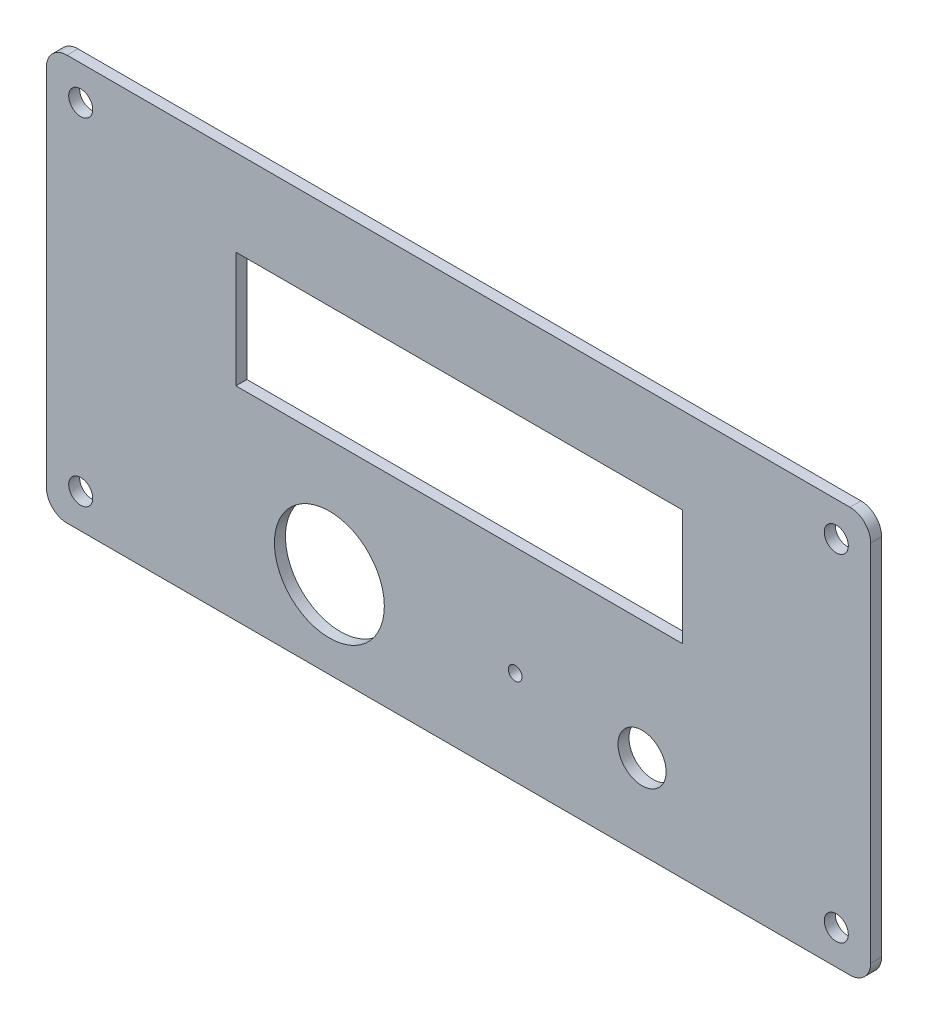
ISO-10303-21;
HEADER;
FILE_DESCRIPTION(('STEP AP214'),'2;1');
FILE_NAME('part.step','',(''),(''),'','','');
FILE_SCHEMA(('AUTOMOTIVE_DESIGN { 1 0 10303 214 1 1 1 1 }'));
ENDSEC;
DATA;
#1=APPLICATION_CONTEXT('core data for automotive mechanical design processes');
#2=APPLICATION_PROTOCOL_DEFINITION('international standard','automotive_design',2000,#1);
#3=PRODUCT_CONTEXT('',#1,'mechanical');
#4=PRODUCT('Part','Part','',(#3));
#5=PRODUCT_RELATED_PRODUCT_CATEGORY('part','',(#4));
#6=PRODUCT_DEFINITION_FORMATION('','',#4);
#7=PRODUCT_DEFINITION_CONTEXT('part definition',#1,'design');
#8=PRODUCT_DEFINITION('design','',#6,#7);
#9=PRODUCT_DEFINITION_SHAPE('','',#8);
#10=(LENGTH_UNIT() NAMED_UNIT(*) SI_UNIT(.MILLI.,.METRE.));
#11=(NAMED_UNIT(*) PLANE_ANGLE_UNIT() SI_UNIT($,.RADIAN.));
#12=(NAMED_UNIT(*) SI_UNIT($,.STERADIAN.) SOLID_ANGLE_UNIT());
#13=UNCERTAINTY_MEASURE_WITH_UNIT(LENGTH_MEASURE(1.E-05),#10,'distance_accuracy_value','');
#14=(GEOMETRIC_REPRESENTATION_CONTEXT(3) GLOBAL_UNCERTAINTY_ASSIGNED_CONTEXT((#13)) GLOBAL_UNIT_ASSIGNED_CONTEXT((#10,
#11,#12)) REPRESENTATION_CONTEXT('',''));
#15=CARTESIAN_POINT('',(0.,0.,0.));
#16=DIRECTION('',(0.,0.,1.));
#17=DIRECTION('',(1.,0.,0.));
#18=AXIS2_PLACEMENT_3D('',#15,#16,#17);
#19=CARTESIAN_POINT('',(0.,33.0731548283817,1.6));
#20=DIRECTION('',(0.,1.,0.));
#21=DIRECTION('',(-1.,0.,0.));
#22=AXIS2_PLACEMENT_3D('',#19,#20,#21);
#23=PLANE('',#22);
#24=DIRECTION('',(1.,0.,0.));
#25=VECTOR('',#24,1.);
#26=CARTESIAN_POINT('',(0.,33.0731548283817,0.));
#27=LINE('',#26,#25);
#28=CARTESIAN_POINT('',(-57.,33.0731548283817,0.));
#29=VERTEX_POINT('',#28);
#30=CARTESIAN_POINT('',(57.,33.0731548283817,0.));
#31=VERTEX_POINT('',#30);
#32=EDGE_CURVE('E195',#29,#31,#27,.T.);
#33=ORIENTED_EDGE('',*,*,#32,.F.);
#34=DIRECTION('',(0.,0.,-1.));
#35=VECTOR('',#34,1.);
#36=CARTESIAN_POINT('',(-57.,33.0731548283817,1.6));
#37=LINE('',#36,#35);
#38=CARTESIAN_POINT('',(-57.,33.0731548283817,1.6));
#39=VERTEX_POINT('',#38);
#40=EDGE_CURVE('E11',#39,#29,#37,.T.);
#41=ORIENTED_EDGE('',*,*,#40,.F.);
#42=DIRECTION('',(1.,0.,0.));
#43=VECTOR('',#42,1.);
#44=CARTESIAN_POINT('',(0.,33.0731548283817,1.6));
#45=LINE('',#44,#43);
#46=CARTESIAN_POINT('',(57.,33.0731548283817,1.6));
#47=VERTEX_POINT('',#46);
#48=EDGE_CURVE('E360',#39,#47,#45,.T.);
#49=ORIENTED_EDGE('',*,*,#48,.T.);
#50=DIRECTION('',(0.,0.,-1.));
#51=VECTOR('',#50,1.);
#52=CARTESIAN_POINT('',(57.,33.0731548283817,1.6));
#53=LINE('',#52,#51);
#54=EDGE_CURVE('E55',#47,#31,#53,.T.);
#55=ORIENTED_EDGE('',*,*,#54,.T.);
#56=EDGE_LOOP('',(#33,#41,#49,#55));
#57=FACE_BOUND('',#56,.T.);
#58=ADVANCED_FACE('F36',(#57),#23,.T.);
#59=CARTESIAN_POINT('',(-57.,30.0731548283817,1.6));
#60=DIRECTION('',(0.,0.,-1.));
#61=DIRECTION('',(-1.,0.,0.));
#62=AXIS2_PLACEMENT_3D('',#59,#60,#61);
#63=CYLINDRICAL_SURFACE('',#62,2.99999999999999);
#64=CARTESIAN_POINT('',(-57.,30.0731548283817,0.));
#65=DIRECTION('',(0.,0.,1.));
#66=DIRECTION('',(1.,0.,0.));
#67=AXIS2_PLACEMENT_3D('',#64,#65,#66);
#68=CIRCLE('',#67,2.99999999999999);
#69=CARTESIAN_POINT('',(-60.,30.0731548283817,0.));
#70=VERTEX_POINT('',#69);
#71=EDGE_CURVE('E197',#29,#70,#68,.T.);
#72=ORIENTED_EDGE('',*,*,#71,.T.);
#73=DIRECTION('',(0.,0.,-1.));
#74=VECTOR('',#73,1.);
#75=CARTESIAN_POINT('',(-60.,30.0731548283817,1.6));
#76=LINE('',#75,#74);
#77=CARTESIAN_POINT('',(-60.,30.0731548283817,1.6));
#78=VERTEX_POINT('',#77);
#79=EDGE_CURVE('E46',#78,#70,#76,.T.);
#80=ORIENTED_EDGE('',*,*,#79,.F.);
#81=CARTESIAN_POINT('',(-57.,30.0731548283817,1.6));
#82=DIRECTION('',(0.,0.,1.));
#83=DIRECTION('',(1.,0.,0.));
#84=AXIS2_PLACEMENT_3D('',#81,#82,#83);
#85=CIRCLE('',#84,2.99999999999999);
#86=EDGE_CURVE('E358',#39,#78,#85,.T.);
#87=ORIENTED_EDGE('',*,*,#86,.F.);
#88=ORIENTED_EDGE('',*,*,#40,.T.);
#89=EDGE_LOOP('',(#72,#80,#87,#88));
#90=FACE_BOUND('',#89,.T.);
#91=ADVANCED_FACE('F269',(#90),#63,.T.);
#92=CARTESIAN_POINT('',(-60.,0.,1.6));
#93=DIRECTION('',(1.,0.,0.));
#94=DIRECTION('',(0.,1.,0.));
#95=AXIS2_PLACEMENT_3D('',#92,#93,#94);
#96=PLANE('',#95);
#97=DIRECTION('',(0.,-1.,0.));
#98=VECTOR('',#97,1.);
#99=CARTESIAN_POINT('',(-60.,0.,0.));
#100=LINE('',#99,#98);
#101=CARTESIAN_POINT('',(-60.,-22.9268451716183,0.));
#102=VERTEX_POINT('',#101);
#103=EDGE_CURVE('E200',#70,#102,#100,.T.);
#104=ORIENTED_EDGE('',*,*,#103,.T.);
#105=DIRECTION('',(0.,0.,-1.));
#106=VECTOR('',#105,1.);
#107=CARTESIAN_POINT('',(-60.,-22.9268451716183,1.6));
#108=LINE('',#107,#106);
#109=CARTESIAN_POINT('',(-60.,-22.9268451716183,1.6));
#110=VERTEX_POINT('',#109);
#111=EDGE_CURVE('E228',#110,#102,#108,.T.);
#112=ORIENTED_EDGE('',*,*,#111,.F.);
#113=DIRECTION('',(0.,-1.,0.));
#114=VECTOR('',#113,1.);
#115=CARTESIAN_POINT('',(-60.,0.,1.6));
#116=LINE('',#115,#114);
#117=EDGE_CURVE('E354',#78,#110,#116,.T.);
#118=ORIENTED_EDGE('',*,*,#117,.F.);
#119=ORIENTED_EDGE('',*,*,#79,.T.);
#120=EDGE_LOOP('',(#104,#112,#118,#119));
#121=FACE_BOUND('',#120,.T.);
#122=ADVANCED_FACE('F274',(#121),#96,.F.);
#123=CARTESIAN_POINT('',(-57.,-22.9268451716183,1.6));
#124=DIRECTION('',(0.,0.,-1.));
#125=DIRECTION('',(-1.,0.,0.));
#126=AXIS2_PLACEMENT_3D('',#123,#124,#125);
#127=CYLINDRICAL_SURFACE('',#126,2.99999999999999);
#128=CARTESIAN_POINT('',(-57.,-22.9268451716183,0.));
#129=DIRECTION('',(0.,0.,1.));
#130=DIRECTION('',(1.,0.,0.));
#131=AXIS2_PLACEMENT_3D('',#128,#129,#130);
#132=CIRCLE('',#131,2.99999999999999);
#133=CARTESIAN_POINT('',(-57.,-25.9268451716183,0.));
#134=VERTEX_POINT('',#133);
#135=EDGE_CURVE('E203',#102,#134,#132,.T.);
#136=ORIENTED_EDGE('',*,*,#135,.T.);
#137=DIRECTION('',(0.,0.,-1.));
#138=VECTOR('',#137,1.);
#139=CARTESIAN_POINT('',(-57.,-25.9268451716183,1.6));
#140=LINE('',#139,#138);
#141=CARTESIAN_POINT('',(-57.,-25.9268451716183,1.6));
#142=VERTEX_POINT('',#141);
#143=EDGE_CURVE('E225',#142,#134,#140,.T.);
#144=ORIENTED_EDGE('',*,*,#143,.F.);
#145=CARTESIAN_POINT('',(-57.,-22.9268451716183,1.6));
#146=DIRECTION('',(0.,0.,1.));
#147=DIRECTION('',(1.,0.,0.));
#148=AXIS2_PLACEMENT_3D('',#145,#146,#147);
#149=CIRCLE('',#148,2.99999999999999);
#150=EDGE_CURVE('E352',#110,#142,#149,.T.);
#151=ORIENTED_EDGE('',*,*,#150,.F.);
#152=ORIENTED_EDGE('',*,*,#111,.T.);
#153=EDGE_LOOP('',(#136,#144,#151,#152));
#154=FACE_BOUND('',#153,.T.);
#155=ADVANCED_FACE('F338',(#154),#127,.T.);
#156=CARTESIAN_POINT('',(0.,-25.9268451716183,1.6));
#157=DIRECTION('',(0.,1.,0.));
#158=DIRECTION('',(0.,0.,1.));
#159=AXIS2_PLACEMENT_3D('',#156,#157,#158);
#160=PLANE('',#159);
#161=DIRECTION('',(1.,0.,0.));
#162=VECTOR('',#161,1.);
#163=CARTESIAN_POINT('',(0.,-25.9268451716183,0.));
#164=LINE('',#163,#162);
#165=CARTESIAN_POINT('',(57.,-25.9268451716183,0.));
#166=VERTEX_POINT('',#165);
#167=EDGE_CURVE('E206',#134,#166,#164,.T.);
#168=ORIENTED_EDGE('',*,*,#167,.T.);
#169=DIRECTION('',(0.,0.,-1.));
#170=VECTOR('',#169,1.);
#171=CARTESIAN_POINT('',(57.,-25.9268451716183,1.6));
#172=LINE('',#171,#170);
#173=CARTESIAN_POINT('',(57.,-25.9268451716183,1.6));
#174=VERTEX_POINT('',#173);
#175=EDGE_CURVE('E153',#174,#166,#172,.T.);
#176=ORIENTED_EDGE('',*,*,#175,.F.);
#177=DIRECTION('',(1.,0.,0.));
#178=VECTOR('',#177,1.);
#179=CARTESIAN_POINT('',(0.,-25.9268451716183,1.6));
#180=LINE('',#179,#178);
#181=EDGE_CURVE('E142',#142,#174,#180,.T.);
#182=ORIENTED_EDGE('',*,*,#181,.F.);
#183=ORIENTED_EDGE('',*,*,#143,.T.);
#184=EDGE_LOOP('',(#168,#176,#182,#183));
#185=FACE_BOUND('',#184,.T.);
#186=ADVANCED_FACE('F335',(#185),#160,.F.);
#187=CARTESIAN_POINT('',(57.,-22.9268451716183,1.6));
#188=DIRECTION('',(0.,0.,-1.));
#189=DIRECTION('',(-1.,0.,0.));
#190=AXIS2_PLACEMENT_3D('',#187,#188,#189);
#191=CYLINDRICAL_SURFACE('',#190,3.00000000000001);
#192=CARTESIAN_POINT('',(57.,-22.9268451716183,0.));
#193=DIRECTION('',(0.,0.,1.));
#194=DIRECTION('',(1.,0.,0.));
#195=AXIS2_PLACEMENT_3D('',#192,#193,#194);
#196=CIRCLE('',#195,3.00000000000001);
#197=CARTESIAN_POINT('',(60.,-22.9268451716183,0.));
#198=VERTEX_POINT('',#197);
#199=EDGE_CURVE('E150',#166,#198,#196,.T.);
#200=ORIENTED_EDGE('',*,*,#199,.T.);
#201=DIRECTION('',(0.,0.,-1.));
#202=VECTOR('',#201,1.);
#203=CARTESIAN_POINT('',(60.,-22.9268451716183,1.6));
#204=LINE('',#203,#202);
#205=CARTESIAN_POINT('',(60.,-22.9268451716183,1.6));
#206=VERTEX_POINT('',#205);
#207=EDGE_CURVE('E148',#206,#198,#204,.T.);
#208=ORIENTED_EDGE('',*,*,#207,.F.);
#209=CARTESIAN_POINT('',(57.,-22.9268451716183,1.6));
#210=DIRECTION('',(0.,0.,1.));
#211=DIRECTION('',(1.,0.,0.));
#212=AXIS2_PLACEMENT_3D('',#209,#210,#211);
#213=CIRCLE('',#212,3.00000000000001);
#214=EDGE_CURVE('E133',#174,#206,#213,.T.);
#215=ORIENTED_EDGE('',*,*,#214,.F.);
#216=ORIENTED_EDGE('',*,*,#175,.T.);
#217=EDGE_LOOP('',(#200,#208,#215,#216));
#218=FACE_BOUND('',#217,.T.);
#219=ADVANCED_FACE('F149',(#218),#191,.T.);
#220=CARTESIAN_POINT('',(60.,0.,1.6));
#221=DIRECTION('',(1.,0.,0.));
#222=DIRECTION('',(0.,1.,0.));
#223=AXIS2_PLACEMENT_3D('',#220,#221,#222);
#224=PLANE('',#223);
#225=DIRECTION('',(0.,-1.,0.));
#226=VECTOR('',#225,1.);
#227=CARTESIAN_POINT('',(60.,0.,0.));
#228=LINE('',#227,#226);
#229=CARTESIAN_POINT('',(60.,30.0731548283817,0.));
#230=VERTEX_POINT('',#229);
#231=EDGE_CURVE('E210',#230,#198,#228,.T.);
#232=ORIENTED_EDGE('',*,*,#231,.F.);
#233=DIRECTION('',(0.,0.,-1.));
#234=VECTOR('',#233,1.);
#235=CARTESIAN_POINT('',(60.,30.0731548283817,1.6));
#236=LINE('',#235,#234);
#237=CARTESIAN_POINT('',(60.,30.0731548283817,1.6));
#238=VERTEX_POINT('',#237);
#239=EDGE_CURVE('E92',#238,#230,#236,.T.);
#240=ORIENTED_EDGE('',*,*,#239,.F.);
#241=DIRECTION('',(0.,-1.,0.));
#242=VECTOR('',#241,1.);
#243=CARTESIAN_POINT('',(60.,0.,1.6));
#244=LINE('',#243,#242);
#245=EDGE_CURVE('E140',#238,#206,#244,.T.);
#246=ORIENTED_EDGE('',*,*,#245,.T.);
#247=ORIENTED_EDGE('',*,*,#207,.T.);
#248=EDGE_LOOP('',(#232,#240,#246,#247));
#249=FACE_BOUND('',#248,.T.);
#250=ADVANCED_FACE('F155',(#249),#224,.T.);
#251=CARTESIAN_POINT('',(0.,20.5275023462411,1.6));
#252=DIRECTION('',(0.,1.,0.));
#253=DIRECTION('',(0.,0.,1.));
#254=AXIS2_PLACEMENT_3D('',#251,#252,#253);
#255=PLANE('',#254);
#256=DIRECTION('',(1.,0.,0.));
#257=VECTOR('',#256,1.);
#258=CARTESIAN_POINT('',(0.,20.5275023462411,0.));
#259=LINE('',#258,#257);
#260=CARTESIAN_POINT('',(-32.4025887583127,20.5275023462411,0.));
#261=VERTEX_POINT('',#260);
#262=CARTESIAN_POINT('',(32.5974112416873,20.5275023462411,0.));
#263=VERTEX_POINT('',#262);
#264=EDGE_CURVE('E180',#261,#263,#259,.T.);
#265=ORIENTED_EDGE('',*,*,#264,.T.);
#266=DIRECTION('',(0.,0.,-1.));
#267=VECTOR('',#266,1.);
#268=CARTESIAN_POINT('',(32.5974112416873,20.5275023462411,1.6));
#269=LINE('',#268,#267);
#270=CARTESIAN_POINT('',(32.5974112416873,20.5275023462411,1.6));
#271=VERTEX_POINT('',#270);
#272=EDGE_CURVE('E40',#271,#263,#269,.T.);
#273=ORIENTED_EDGE('',*,*,#272,.F.);
#274=DIRECTION('',(1.,0.,0.));
#275=VECTOR('',#274,1.);
#276=CARTESIAN_POINT('',(0.,20.5275023462411,1.6));
#277=LINE('',#276,#275);
#278=CARTESIAN_POINT('',(-32.4025887583127,20.5275023462411,1.6));
#279=VERTEX_POINT('',#278);
#280=EDGE_CURVE('E371',#279,#271,#277,.T.);
#281=ORIENTED_EDGE('',*,*,#280,.F.);
#282=DIRECTION('',(0.,0.,-1.));
#283=VECTOR('',#282,1.);
#284=CARTESIAN_POINT('',(-32.4025887583127,20.5275023462411,1.6));
#285=LINE('',#284,#283);
#286=EDGE_CURVE('E167',#279,#261,#285,.T.);
#287=ORIENTED_EDGE('',*,*,#286,.T.);
#288=EDGE_LOOP('',(#265,#273,#281,#287));
#289=FACE_BOUND('',#288,.T.);
#290=ADVANCED_FACE('F244',(#289),#255,.F.);
#291=CARTESIAN_POINT('',(32.5974112416874,1.0738990060444E-13,1.6));
#292=DIRECTION('',(1.,0.,0.));
#293=DIRECTION('',(0.,1.,0.));
#294=AXIS2_PLACEMENT_3D('',#291,#292,#293);
#295=PLANE('',#294);
#296=DIRECTION('',(0.,-1.,0.));
#297=VECTOR('',#296,1.);
#298=CARTESIAN_POINT('',(32.5974112416874,1.0738990060444E-13,0.));
#299=LINE('',#298,#297);
#300=CARTESIAN_POINT('',(32.5974112416873,3.67750234624111,0.));
#301=VERTEX_POINT('',#300);
#302=EDGE_CURVE('E183',#263,#301,#299,.T.);
#303=ORIENTED_EDGE('',*,*,#302,.T.);
#304=DIRECTION('',(0.,0.,-1.));
#305=VECTOR('',#304,1.);
#306=CARTESIAN_POINT('',(32.5974112416873,3.67750234624111,1.6));
#307=LINE('',#306,#305);
#308=CARTESIAN_POINT('',(32.5974112416873,3.67750234624111,1.6));
#309=VERTEX_POINT('',#308);
#310=EDGE_CURVE('E235',#309,#301,#307,.T.);
#311=ORIENTED_EDGE('',*,*,#310,.F.);
#312=DIRECTION('',(0.,-1.,0.));
#313=VECTOR('',#312,1.);
#314=CARTESIAN_POINT('',(32.5974112416874,1.0738990060444E-13,1.6));
#315=LINE('',#314,#313);
#316=EDGE_CURVE('E105',#271,#309,#315,.T.);
#317=ORIENTED_EDGE('',*,*,#316,.F.);
#318=ORIENTED_EDGE('',*,*,#272,.T.);
#319=EDGE_LOOP('',(#303,#311,#317,#318));
#320=FACE_BOUND('',#319,.T.);
#321=ADVANCED_FACE('F240',(#320),#295,.F.);
#322=CARTESIAN_POINT('',(0.,3.67750234624111,1.6));
#323=DIRECTION('',(0.,1.,0.));
#324=DIRECTION('',(0.,0.,1.));
#325=AXIS2_PLACEMENT_3D('',#322,#323,#324);
#326=PLANE('',#325);
#327=DIRECTION('',(1.,0.,0.));
#328=VECTOR('',#327,1.);
#329=CARTESIAN_POINT('',(0.,3.67750234624111,0.));
#330=LINE('',#329,#328);
#331=CARTESIAN_POINT('',(-32.4025887583127,3.67750234624111,0.));
#332=VERTEX_POINT('',#331);
#333=EDGE_CURVE('E186',#332,#301,#330,.T.);
#334=ORIENTED_EDGE('',*,*,#333,.F.);
#335=DIRECTION('',(0.,0.,-1.));
#336=VECTOR('',#335,1.);
#337=CARTESIAN_POINT('',(-32.4025887583127,3.67750234624111,1.6));
#338=LINE('',#337,#336);
#339=CARTESIAN_POINT('',(-32.4025887583127,3.67750234624111,1.6));
#340=VERTEX_POINT('',#339);
#341=EDGE_CURVE('E234',#340,#332,#338,.T.);
#342=ORIENTED_EDGE('',*,*,#341,.F.);
#343=DIRECTION('',(1.,0.,0.));
#344=VECTOR('',#343,1.);
#345=CARTESIAN_POINT('',(0.,3.67750234624111,1.6));
#346=LINE('',#345,#344);
#347=EDGE_CURVE('E368',#340,#309,#346,.T.);
#348=ORIENTED_EDGE('',*,*,#347,.T.);
#349=ORIENTED_EDGE('',*,*,#310,.T.);
#350=EDGE_LOOP('',(#334,#342,#348,#349));
#351=FACE_BOUND('',#350,.T.);
#352=ADVANCED_FACE('F255',(#351),#326,.T.);
#353=CARTESIAN_POINT('',(55.,28.0731548283817,1.6));
#354=DIRECTION('',(0.,0.,-1.));
#355=DIRECTION('',(-1.,0.,0.));
#356=AXIS2_PLACEMENT_3D('',#353,#354,#355);
#357=CYLINDRICAL_SURFACE('',#356,1.75);
#358=CARTESIAN_POINT('',(55.,28.0731548283817,1.6));
#359=DIRECTION('',(0.,0.,1.));
#360=DIRECTION('',(1.,0.,0.));
#361=AXIS2_PLACEMENT_3D('',#358,#359,#360);
#362=CIRCLE('',#361,1.75);
#363=CARTESIAN_POINT('',(56.75,28.0731548283817,1.6));
#364=VERTEX_POINT('',#363);
#365=EDGE_CURVE('E158',#364,#364,#362,.T.);
#366=ORIENTED_EDGE('',*,*,#365,.T.);
#367=EDGE_LOOP('',(#366));
#368=FACE_BOUND('',#367,.T.);
#369=CARTESIAN_POINT('',(55.,28.0731548283817,0.));
#370=DIRECTION('',(0.,0.,1.));
#371=DIRECTION('',(1.,0.,0.));
#372=AXIS2_PLACEMENT_3D('',#369,#370,#371);
#373=CIRCLE('',#372,1.75);
#374=CARTESIAN_POINT('',(56.75,28.0731548283817,0.));
#375=VERTEX_POINT('',#374);
#376=EDGE_CURVE('E215',#375,#375,#373,.T.);
#377=ORIENTED_EDGE('',*,*,#376,.F.);
#378=EDGE_LOOP('',(#377));
#379=FACE_BOUND('',#378,.T.);
#380=ADVANCED_FACE('F257',(#368,#379),#357,.F.);
#381=CARTESIAN_POINT('',(57.,30.0731548283817,1.6));
#382=DIRECTION('',(0.,0.,-1.));
#383=DIRECTION('',(-1.,0.,0.));
#384=AXIS2_PLACEMENT_3D('',#381,#382,#383);
#385=CYLINDRICAL_SURFACE('',#384,3.00000000000001);
#386=CARTESIAN_POINT('',(57.,30.0731548283817,0.));
#387=DIRECTION('',(0.,0.,1.));
#388=DIRECTION('',(1.,0.,0.));
#389=AXIS2_PLACEMENT_3D('',#386,#387,#388);
#390=CIRCLE('',#389,3.00000000000001);
#391=EDGE_CURVE('E212',#31,#230,#390,.F.);
#392=ORIENTED_EDGE('',*,*,#391,.F.);
#393=ORIENTED_EDGE('',*,*,#54,.F.);
#394=CARTESIAN_POINT('',(57.,30.0731548283817,1.6));
#395=DIRECTION('',(0.,0.,1.));
#396=DIRECTION('',(1.,0.,0.));
#397=AXIS2_PLACEMENT_3D('',#394,#395,#396);
#398=CIRCLE('',#397,3.00000000000001);
#399=EDGE_CURVE('E156',#47,#238,#398,.F.);
#400=ORIENTED_EDGE('',*,*,#399,.T.);
#401=ORIENTED_EDGE('',*,*,#239,.T.);
#402=EDGE_LOOP('',(#392,#393,#400,#401));
#403=FACE_BOUND('',#402,.T.);
#404=ADVANCED_FACE('F263',(#403),#385,.T.);
#405=CARTESIAN_POINT('',(-55.,-20.9268451716183,1.6));
#406=DIRECTION('',(0.,0.,-1.));
#407=DIRECTION('',(-1.,0.,0.));
#408=AXIS2_PLACEMENT_3D('',#405,#406,#407);
#409=CYLINDRICAL_SURFACE('',#408,1.75);
#410=CARTESIAN_POINT('',(-55.,-20.9268451716183,1.6));
#411=DIRECTION('',(0.,0.,1.));
#412=DIRECTION('',(1.,0.,0.));
#413=AXIS2_PLACEMENT_3D('',#410,#411,#412);
#414=CIRCLE('',#413,1.75);
#415=CARTESIAN_POINT('',(-53.25,-20.9268451716183,1.6));
#416=VERTEX_POINT('',#415);
#417=EDGE_CURVE('E364',#416,#416,#414,.T.);
#418=ORIENTED_EDGE('',*,*,#417,.T.);
#419=EDGE_LOOP('',(#418));
#420=FACE_BOUND('',#419,.T.);
#421=CARTESIAN_POINT('',(-55.,-20.9268451716183,0.));
#422=DIRECTION('',(0.,0.,1.));
#423=DIRECTION('',(1.,0.,0.));
#424=AXIS2_PLACEMENT_3D('',#421,#422,#423);
#425=CIRCLE('',#424,1.75);
#426=CARTESIAN_POINT('',(-53.25,-20.9268451716183,0.));
#427=VERTEX_POINT('',#426);
#428=EDGE_CURVE('E192',#427,#427,#425,.T.);
#429=ORIENTED_EDGE('',*,*,#428,.F.);
#430=EDGE_LOOP('',(#429));
#431=FACE_BOUND('',#430,.T.);
#432=ADVANCED_FACE('F279',(#420,#431),#409,.F.);
#433=CARTESIAN_POINT('',(-32.4025887583127,0.,1.6));
#434=DIRECTION('',(1.,0.,0.));
#435=DIRECTION('',(0.,0.,-1.));
#436=AXIS2_PLACEMENT_3D('',#433,#434,#435);
#437=PLANE('',#436);
#438=DIRECTION('',(0.,-1.,0.));
#439=VECTOR('',#438,1.);
#440=CARTESIAN_POINT('',(-32.4025887583127,0.,0.));
#441=LINE('',#440,#439);
#442=EDGE_CURVE('E189',#261,#332,#441,.T.);
#443=ORIENTED_EDGE('',*,*,#442,.F.);
#444=ORIENTED_EDGE('',*,*,#286,.F.);
#445=DIRECTION('',(0.,-1.,0.));
#446=VECTOR('',#445,1.);
#447=CARTESIAN_POINT('',(-32.4025887583127,0.,1.6));
#448=LINE('',#447,#446);
#449=EDGE_CURVE('E253',#279,#340,#448,.T.);
#450=ORIENTED_EDGE('',*,*,#449,.T.);
#451=ORIENTED_EDGE('',*,*,#341,.T.);
#452=EDGE_LOOP('',(#443,#444,#450,#451));
#453=FACE_BOUND('',#452,.T.);
#454=ADVANCED_FACE('F250',(#453),#437,.T.);
#455=CARTESIAN_POINT('',(55.,-20.9268451716183,1.6));
#456=DIRECTION('',(0.,0.,-1.));
#457=DIRECTION('',(-1.,0.,0.));
#458=AXIS2_PLACEMENT_3D('',#455,#456,#457);
#459=CYLINDRICAL_SURFACE('',#458,1.75);
#460=CARTESIAN_POINT('',(55.,-20.9268451716183,1.6));
#461=DIRECTION('',(0.,0.,1.));
#462=DIRECTION('',(1.,0.,0.));
#463=AXIS2_PLACEMENT_3D('',#460,#461,#462);
#464=CIRCLE('',#463,1.75);
#465=CARTESIAN_POINT('',(56.75,-20.9268451716183,1.6));
#466=VERTEX_POINT('',#465);
#467=EDGE_CURVE('E373',#466,#466,#464,.F.);
#468=ORIENTED_EDGE('',*,*,#467,.F.);
#469=EDGE_LOOP('',(#468));
#470=FACE_BOUND('',#469,.T.);
#471=CARTESIAN_POINT('',(55.,-20.9268451716183,0.));
#472=DIRECTION('',(0.,0.,1.));
#473=DIRECTION('',(1.,0.,0.));
#474=AXIS2_PLACEMENT_3D('',#471,#472,#473);
#475=CIRCLE('',#474,1.75);
#476=CARTESIAN_POINT('',(56.75,-20.9268451716183,0.));
#477=VERTEX_POINT('',#476);
#478=EDGE_CURVE('E177',#477,#477,#475,.F.);
#479=ORIENTED_EDGE('',*,*,#478,.T.);
#480=EDGE_LOOP('',(#479));
#481=FACE_BOUND('',#480,.T.);
#482=ADVANCED_FACE('F283',(#470,#481),#459,.F.);
#483=CARTESIAN_POINT('',(26.7211188616873,-13.6824976537589,1.6));
#484=DIRECTION('',(0.,0.,-1.));
#485=DIRECTION('',(-1.,0.,0.));
#486=AXIS2_PLACEMENT_3D('',#483,#484,#485);
#487=CYLINDRICAL_SURFACE('',#486,3.5);
#488=CARTESIAN_POINT('',(26.7211188616873,-13.6824976537589,1.6));
#489=DIRECTION('',(0.,0.,1.));
#490=DIRECTION('',(1.,0.,0.));
#491=AXIS2_PLACEMENT_3D('',#488,#489,#490);
#492=CIRCLE('',#491,3.5);
#493=CARTESIAN_POINT('',(30.2211188616873,-13.6824976537589,1.6));
#494=VERTEX_POINT('',#493);
#495=EDGE_CURVE('E376',#494,#494,#492,.T.);
#496=ORIENTED_EDGE('',*,*,#495,.T.);
#497=EDGE_LOOP('',(#496));
#498=FACE_BOUND('',#497,.T.);
#499=CARTESIAN_POINT('',(26.7211188616873,-13.6824976537589,0.));
#500=DIRECTION('',(0.,0.,1.));
#501=DIRECTION('',(1.,0.,0.));
#502=AXIS2_PLACEMENT_3D('',#499,#500,#501);
#503=CIRCLE('',#502,3.5);
#504=CARTESIAN_POINT('',(30.2211188616873,-13.6824976537589,0.));
#505=VERTEX_POINT('',#504);
#506=EDGE_CURVE('E174',#505,#505,#503,.T.);
#507=ORIENTED_EDGE('',*,*,#506,.F.);
#508=EDGE_LOOP('',(#507));
#509=FACE_BOUND('',#508,.T.);
#510=ADVANCED_FACE('F287',(#498,#509),#487,.F.);
#511=CARTESIAN_POINT('',(-18.7988807583127,-13.3124976537589,1.6));
#512=DIRECTION('',(0.,0.,-1.));
#513=DIRECTION('',(-1.,0.,0.));
#514=AXIS2_PLACEMENT_3D('',#511,#512,#513);
#515=CYLINDRICAL_SURFACE('',#514,8.00000000000001);
#516=CARTESIAN_POINT('',(-18.7988807583127,-13.3124976537589,1.6));
#517=DIRECTION('',(0.,0.,1.));
#518=DIRECTION('',(1.,0.,0.));
#519=AXIS2_PLACEMENT_3D('',#516,#517,#518);
#520=CIRCLE('',#519,8.00000000000001);
#521=CARTESIAN_POINT('',(-10.7988807583126,-13.3124976537589,1.6));
#522=VERTEX_POINT('',#521);
#523=EDGE_CURVE('E309',#522,#522,#520,.T.);
#524=ORIENTED_EDGE('',*,*,#523,.T.);
#525=EDGE_LOOP('',(#524));
#526=FACE_BOUND('',#525,.T.);
#527=CARTESIAN_POINT('',(-18.7988807583127,-13.3124976537589,0.));
#528=DIRECTION('',(0.,0.,1.));
#529=DIRECTION('',(1.,0.,0.));
#530=AXIS2_PLACEMENT_3D('',#527,#528,#529);
#531=CIRCLE('',#530,8.00000000000001);
#532=CARTESIAN_POINT('',(-10.7988807583126,-13.3124976537589,0.));
#533=VERTEX_POINT('',#532);
#534=EDGE_CURVE('E171',#533,#533,#531,.T.);
#535=ORIENTED_EDGE('',*,*,#534,.F.);
#536=EDGE_LOOP('',(#535));
#537=FACE_BOUND('',#536,.T.);
#538=ADVANCED_FACE('F293',(#526,#537),#515,.F.);
#539=CARTESIAN_POINT('',(8.25111924168735,-12.2224976537589,1.6));
#540=DIRECTION('',(0.,0.,-1.));
#541=DIRECTION('',(-1.,0.,0.));
#542=AXIS2_PLACEMENT_3D('',#539,#540,#541);
#543=CYLINDRICAL_SURFACE('',#542,0.999999999999998);
#544=CARTESIAN_POINT('',(8.25111924168735,-12.2224976537589,1.6));
#545=DIRECTION('',(0.,0.,1.));
#546=DIRECTION('',(1.,0.,0.));
#547=AXIS2_PLACEMENT_3D('',#544,#545,#546);
#548=CIRCLE('',#547,0.999999999999998);
#549=CARTESIAN_POINT('',(9.25111924168735,-12.2224976537589,1.6));
#550=VERTEX_POINT('',#549);
#551=EDGE_CURVE('E221',#550,#550,#548,.T.);
#552=ORIENTED_EDGE('',*,*,#551,.T.);
#553=EDGE_LOOP('',(#552));
#554=FACE_BOUND('',#553,.T.);
#555=CARTESIAN_POINT('',(8.25111924168735,-12.2224976537589,0.));
#556=DIRECTION('',(0.,0.,1.));
#557=DIRECTION('',(1.,0.,0.));
#558=AXIS2_PLACEMENT_3D('',#555,#556,#557);
#559=CIRCLE('',#558,0.999999999999998);
#560=CARTESIAN_POINT('',(9.25111924168735,-12.2224976537589,0.));
#561=VERTEX_POINT('',#560);
#562=EDGE_CURVE('E168',#561,#561,#559,.T.);
#563=ORIENTED_EDGE('',*,*,#562,.F.);
#564=EDGE_LOOP('',(#563));
#565=FACE_BOUND('',#564,.T.);
#566=ADVANCED_FACE('F38',(#554,#565),#543,.F.);
#567=CARTESIAN_POINT('',(-55.,28.0731548283817,1.6));
#568=DIRECTION('',(0.,0.,-1.));
#569=DIRECTION('',(-1.,0.,0.));
#570=AXIS2_PLACEMENT_3D('',#567,#568,#569);
#571=CYLINDRICAL_SURFACE('',#570,1.75);
#572=CARTESIAN_POINT('',(-55.,28.0731548283817,1.6));
#573=DIRECTION('',(0.,0.,1.));
#574=DIRECTION('',(1.,0.,0.));
#575=AXIS2_PLACEMENT_3D('',#572,#573,#574);
#576=CIRCLE('',#575,1.75);
#577=CARTESIAN_POINT('',(-53.25,28.0731548283817,1.6));
#578=VERTEX_POINT('',#577);
#579=EDGE_CURVE('E164',#578,#578,#576,.F.);
#580=ORIENTED_EDGE('',*,*,#579,.F.);
#581=EDGE_LOOP('',(#580));
#582=FACE_BOUND('',#581,.T.);
#583=CARTESIAN_POINT('',(-55.,28.0731548283817,0.));
#584=DIRECTION('',(0.,0.,1.));
#585=DIRECTION('',(1.,0.,0.));
#586=AXIS2_PLACEMENT_3D('',#583,#584,#585);
#587=CIRCLE('',#586,1.75);
#588=CARTESIAN_POINT('',(-53.25,28.0731548283817,0.));
#589=VERTEX_POINT('',#588);
#590=EDGE_CURVE('E218',#589,#589,#587,.F.);
#591=ORIENTED_EDGE('',*,*,#590,.T.);
#592=EDGE_LOOP('',(#591));
#593=FACE_BOUND('',#592,.T.);
#594=ADVANCED_FACE('F304',(#582,#593),#571,.F.);
#595=CARTESIAN_POINT('',(0.,0.,1.6));
#596=DIRECTION('',(0.,0.,1.));
#597=DIRECTION('',(1.,0.,0.));
#598=AXIS2_PLACEMENT_3D('',#595,#596,#597);
#599=PLANE('',#598);
#600=ORIENTED_EDGE('',*,*,#551,.F.);
#601=EDGE_LOOP('',(#600));
#602=FACE_BOUND('',#601,.T.);
#603=ORIENTED_EDGE('',*,*,#523,.F.);
#604=EDGE_LOOP('',(#603));
#605=FACE_BOUND('',#604,.T.);
#606=ORIENTED_EDGE('',*,*,#495,.F.);
#607=EDGE_LOOP('',(#606));
#608=FACE_BOUND('',#607,.T.);
#609=ORIENTED_EDGE('',*,*,#467,.T.);
#610=EDGE_LOOP('',(#609));
#611=FACE_BOUND('',#610,.T.);
#612=ORIENTED_EDGE('',*,*,#280,.T.);
#613=ORIENTED_EDGE('',*,*,#316,.T.);
#614=ORIENTED_EDGE('',*,*,#347,.F.);
#615=ORIENTED_EDGE('',*,*,#449,.F.);
#616=EDGE_LOOP('',(#612,#613,#614,#615));
#617=FACE_BOUND('',#616,.T.);
#618=ORIENTED_EDGE('',*,*,#417,.F.);
#619=EDGE_LOOP('',(#618));
#620=FACE_BOUND('',#619,.T.);
#621=ORIENTED_EDGE('',*,*,#48,.F.);
#622=ORIENTED_EDGE('',*,*,#86,.T.);
#623=ORIENTED_EDGE('',*,*,#117,.T.);
#624=ORIENTED_EDGE('',*,*,#150,.T.);
#625=ORIENTED_EDGE('',*,*,#181,.T.);
#626=ORIENTED_EDGE('',*,*,#214,.T.);
#627=ORIENTED_EDGE('',*,*,#245,.F.);
#628=ORIENTED_EDGE('',*,*,#399,.F.);
#629=EDGE_LOOP('',(#621,#622,#623,#624,#625,#626,#627,#628));
#630=FACE_BOUND('',#629,.T.);
#631=ORIENTED_EDGE('',*,*,#365,.F.);
#632=EDGE_LOOP('',(#631));
#633=FACE_BOUND('',#632,.T.);
#634=ORIENTED_EDGE('',*,*,#579,.T.);
#635=EDGE_LOOP('',(#634));
#636=FACE_BOUND('',#635,.T.);
#637=ADVANCED_FACE('F136',(#602,#605,#608,#611,#617,#620,#630,#633,#636),#599,.T.);
#638=CARTESIAN_POINT('',(0.,0.,0.));
#639=DIRECTION('',(0.,0.,1.));
#640=DIRECTION('',(1.,0.,0.));
#641=AXIS2_PLACEMENT_3D('',#638,#639,#640);
#642=PLANE('',#641);
#643=ORIENTED_EDGE('',*,*,#562,.T.);
#644=EDGE_LOOP('',(#643));
#645=FACE_BOUND('',#644,.T.);
#646=ORIENTED_EDGE('',*,*,#534,.T.);
#647=EDGE_LOOP('',(#646));
#648=FACE_BOUND('',#647,.T.);
#649=ORIENTED_EDGE('',*,*,#506,.T.);
#650=EDGE_LOOP('',(#649));
#651=FACE_BOUND('',#650,.T.);
#652=ORIENTED_EDGE('',*,*,#478,.F.);
#653=EDGE_LOOP('',(#652));
#654=FACE_BOUND('',#653,.T.);
#655=ORIENTED_EDGE('',*,*,#264,.F.);
#656=ORIENTED_EDGE('',*,*,#442,.T.);
#657=ORIENTED_EDGE('',*,*,#333,.T.);
#658=ORIENTED_EDGE('',*,*,#302,.F.);
#659=EDGE_LOOP('',(#655,#656,#657,#658));
#660=FACE_BOUND('',#659,.T.);
#661=ORIENTED_EDGE('',*,*,#428,.T.);
#662=EDGE_LOOP('',(#661));
#663=FACE_BOUND('',#662,.T.);
#664=ORIENTED_EDGE('',*,*,#32,.T.);
#665=ORIENTED_EDGE('',*,*,#391,.T.);
#666=ORIENTED_EDGE('',*,*,#231,.T.);
#667=ORIENTED_EDGE('',*,*,#199,.F.);
#668=ORIENTED_EDGE('',*,*,#167,.F.);
#669=ORIENTED_EDGE('',*,*,#135,.F.);
#670=ORIENTED_EDGE('',*,*,#103,.F.);
#671=ORIENTED_EDGE('',*,*,#71,.F.);
#672=EDGE_LOOP('',(#664,#665,#666,#667,#668,#669,#670,#671));
#673=FACE_BOUND('',#672,.T.);
#674=ORIENTED_EDGE('',*,*,#376,.T.);
#675=EDGE_LOOP('',(#674));
#676=FACE_BOUND('',#675,.T.);
#677=ORIENTED_EDGE('',*,*,#590,.F.);
#678=EDGE_LOOP('',(#677));
#679=FACE_BOUND('',#678,.T.);
#680=ADVANCED_FACE('F247',(#645,#648,#651,#654,#660,#663,#673,#676,#679),#642,.F.);
#681=CLOSED_SHELL('',(#58,#91,#122,#155,#186,#219,#250,#290,#321,#352,#380,#404,#432,#454,#482,
#510,#538,#566,#594,#637,#680));
#682=MANIFOLD_SOLID_BREP('B2',#681);
#683=ADVANCED_BREP_SHAPE_REPRESENTATION('',(#18,#682),#14);
#684=SHAPE_DEFINITION_REPRESENTATION(#9,#683);
ENDSEC;
END-ISO-10303-21;
